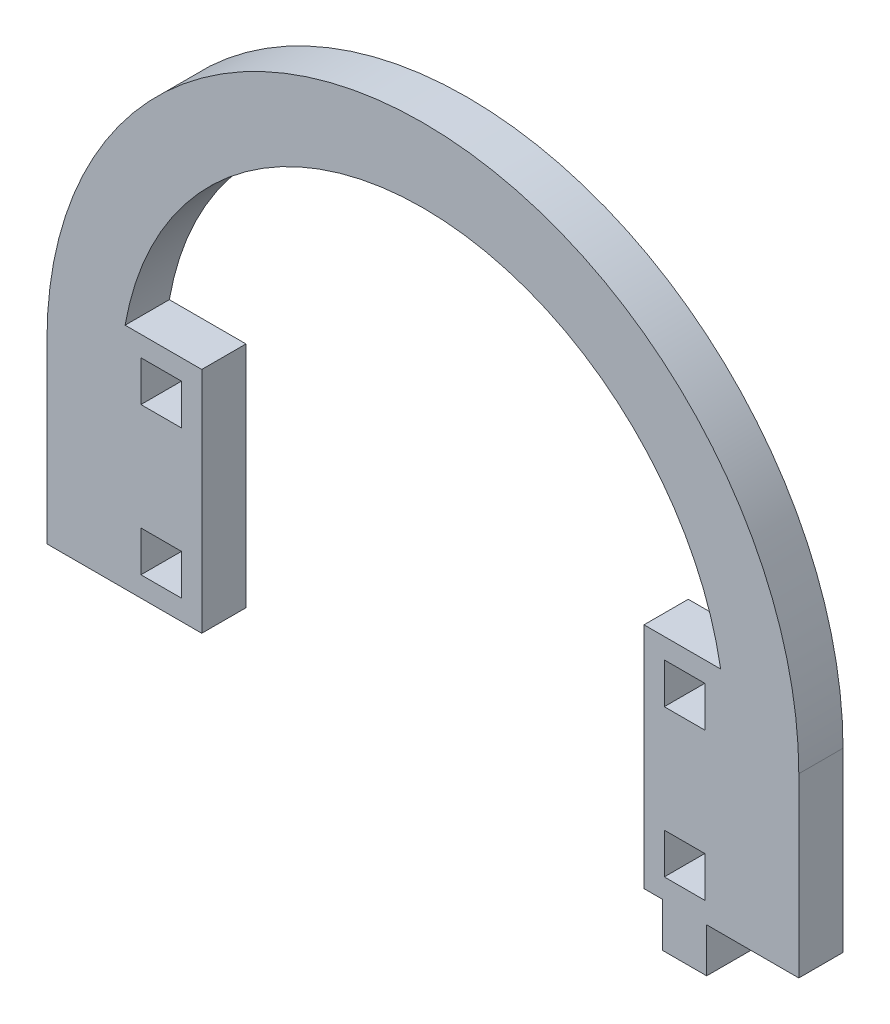
ISO-10303-21;
HEADER;
FILE_DESCRIPTION(('STEP AP214'),'2;1');
FILE_NAME('part.step','',(''),(''),'','','');
FILE_SCHEMA(('AUTOMOTIVE_DESIGN { 1 0 10303 214 1 1 1 1 }'));
ENDSEC;
DATA;
#1=APPLICATION_CONTEXT('core data for automotive mechanical design processes');
#2=APPLICATION_PROTOCOL_DEFINITION('international standard','automotive_design',2000,#1);
#3=PRODUCT_CONTEXT('',#1,'mechanical');
#4=PRODUCT('Part','Part','',(#3));
#5=PRODUCT_RELATED_PRODUCT_CATEGORY('part','',(#4));
#6=PRODUCT_DEFINITION_FORMATION('','',#4);
#7=PRODUCT_DEFINITION_CONTEXT('part definition',#1,'design');
#8=PRODUCT_DEFINITION('design','',#6,#7);
#9=PRODUCT_DEFINITION_SHAPE('','',#8);
#10=(LENGTH_UNIT() NAMED_UNIT(*) SI_UNIT(.MILLI.,.METRE.));
#11=(NAMED_UNIT(*) PLANE_ANGLE_UNIT() SI_UNIT($,.RADIAN.));
#12=(NAMED_UNIT(*) SI_UNIT($,.STERADIAN.) SOLID_ANGLE_UNIT());
#13=UNCERTAINTY_MEASURE_WITH_UNIT(LENGTH_MEASURE(1.E-05),#10,'distance_accuracy_value','');
#14=(GEOMETRIC_REPRESENTATION_CONTEXT(3) GLOBAL_UNCERTAINTY_ASSIGNED_CONTEXT((#13)) GLOBAL_UNIT_ASSIGNED_CONTEXT((#10,
#11,#12)) REPRESENTATION_CONTEXT('',''));
#15=CARTESIAN_POINT('',(0.,0.,0.));
#16=DIRECTION('',(0.,0.,1.));
#17=DIRECTION('',(1.,0.,0.));
#18=AXIS2_PLACEMENT_3D('',#15,#16,#17);
#19=CARTESIAN_POINT('',(3503.90039403022,1295.06850236127,6.));
#20=DIRECTION('',(0.,0.,1.));
#21=DIRECTION('',(1.,0.,0.));
#22=AXIS2_PLACEMENT_3D('',#19,#20,#21);
#23=PLANE('',#22);
#24=CARTESIAN_POINT('',(3503.90039403022,1295.06850236127,6.));
#25=DIRECTION('',(0.,0.,1.));
#26=DIRECTION('',(1.,0.,0.));
#27=AXIS2_PLACEMENT_3D('',#24,#25,#26);
#28=CIRCLE('',#27,50.9999999999999);
#29=CARTESIAN_POINT('',(3554.90039403022,1295.06850236127,6.));
#30=VERTEX_POINT('',#29);
#31=CARTESIAN_POINT('',(3452.90039403022,1295.06850236127,6.));
#32=VERTEX_POINT('',#31);
#33=EDGE_CURVE('E642',#30,#32,#28,.T.);
#34=ORIENTED_EDGE('',*,*,#33,.T.);
#35=DIRECTION('',(0.,-1.,0.));
#36=VECTOR('',#35,1.);
#37=CARTESIAN_POINT('',(3452.90039403022,1295.06850236127,6.));
#38=LINE('',#37,#36);
#39=CARTESIAN_POINT('',(3452.90039403022,1271.06850236127,6.));
#40=VERTEX_POINT('',#39);
#41=EDGE_CURVE('E646',#32,#40,#38,.T.);
#42=ORIENTED_EDGE('',*,*,#41,.T.);
#43=DIRECTION('',(1.,0.,0.));
#44=VECTOR('',#43,1.);
#45=CARTESIAN_POINT('',(3452.90039403022,1271.06850236127,6.));
#46=LINE('',#45,#44);
#47=CARTESIAN_POINT('',(3473.90039403022,1271.06850236127,6.));
#48=VERTEX_POINT('',#47);
#49=EDGE_CURVE('E650',#40,#48,#46,.T.);
#50=ORIENTED_EDGE('',*,*,#49,.T.);
#51=DIRECTION('',(0.,-1.,0.));
#52=VECTOR('',#51,1.);
#53=CARTESIAN_POINT('',(3473.90039403022,1302.06850236127,6.));
#54=LINE('',#53,#52);
#55=CARTESIAN_POINT('',(3473.90039403022,1302.06850236127,6.));
#56=VERTEX_POINT('',#55);
#57=EDGE_CURVE('E653',#56,#48,#54,.T.);
#58=ORIENTED_EDGE('',*,*,#57,.F.);
#59=DIRECTION('',(-1.,0.,0.));
#60=VECTOR('',#59,1.);
#61=CARTESIAN_POINT('',(3473.90039403022,1302.06850236127,6.));
#62=LINE('',#61,#60);
#63=CARTESIAN_POINT('',(3463.50237427677,1302.06850236127,6.));
#64=VERTEX_POINT('',#63);
#65=EDGE_CURVE('E657',#56,#64,#62,.T.);
#66=ORIENTED_EDGE('',*,*,#65,.T.);
#67=CARTESIAN_POINT('',(3503.90039403022,1295.06850236127,6.));
#68=DIRECTION('',(0.,0.,1.));
#69=DIRECTION('',(1.,0.,0.));
#70=AXIS2_PLACEMENT_3D('',#67,#68,#69);
#71=CIRCLE('',#70,41.0000000000002);
#72=CARTESIAN_POINT('',(3544.29841378367,1302.06850236127,6.));
#73=VERTEX_POINT('',#72);
#74=EDGE_CURVE('E660',#73,#64,#71,.T.);
#75=ORIENTED_EDGE('',*,*,#74,.F.);
#76=DIRECTION('',(-1.,0.,0.));
#77=VECTOR('',#76,1.);
#78=CARTESIAN_POINT('',(3544.29841378367,1302.06850236127,6.));
#79=LINE('',#78,#77);
#80=CARTESIAN_POINT('',(3533.90039403022,1302.06850236127,6.));
#81=VERTEX_POINT('',#80);
#82=EDGE_CURVE('E664',#73,#81,#79,.T.);
#83=ORIENTED_EDGE('',*,*,#82,.T.);
#84=DIRECTION('',(0.,-1.,0.));
#85=VECTOR('',#84,1.);
#86=CARTESIAN_POINT('',(3533.90039403022,1302.06850236127,6.));
#87=LINE('',#86,#85);
#88=CARTESIAN_POINT('',(3533.90039403022,1271.06850236127,6.));
#89=VERTEX_POINT('',#88);
#90=EDGE_CURVE('E667',#81,#89,#87,.T.);
#91=ORIENTED_EDGE('',*,*,#90,.T.);
#92=DIRECTION('',(1.,0.,0.));
#93=VECTOR('',#92,1.);
#94=CARTESIAN_POINT('',(3533.90039403022,1271.06850236127,6.));
#95=LINE('',#94,#93);
#96=CARTESIAN_POINT('',(3536.40039403022,1271.06850236127,6.));
#97=VERTEX_POINT('',#96);
#98=EDGE_CURVE('E670',#89,#97,#95,.T.);
#99=ORIENTED_EDGE('',*,*,#98,.T.);
#100=DIRECTION('',(0.,-1.,0.));
#101=VECTOR('',#100,1.);
#102=CARTESIAN_POINT('',(3536.40039403022,1271.06850236127,6.));
#103=LINE('',#102,#101);
#104=CARTESIAN_POINT('',(3536.40039403022,1265.06850236127,6.));
#105=VERTEX_POINT('',#104);
#106=EDGE_CURVE('E673',#97,#105,#103,.T.);
#107=ORIENTED_EDGE('',*,*,#106,.T.);
#108=DIRECTION('',(1.,0.,0.));
#109=VECTOR('',#108,1.);
#110=CARTESIAN_POINT('',(3536.40039403022,1265.06850236127,6.));
#111=LINE('',#110,#109);
#112=CARTESIAN_POINT('',(3542.40039403022,1265.06850236127,6.));
#113=VERTEX_POINT('',#112);
#114=EDGE_CURVE('E676',#105,#113,#111,.T.);
#115=ORIENTED_EDGE('',*,*,#114,.T.);
#116=DIRECTION('',(0.,1.,0.));
#117=VECTOR('',#116,1.);
#118=CARTESIAN_POINT('',(3542.40039403022,1265.06850236127,6.));
#119=LINE('',#118,#117);
#120=CARTESIAN_POINT('',(3542.40039403022,1271.06850236127,6.));
#121=VERTEX_POINT('',#120);
#122=EDGE_CURVE('E679',#113,#121,#119,.T.);
#123=ORIENTED_EDGE('',*,*,#122,.T.);
#124=DIRECTION('',(1.,0.,0.));
#125=VECTOR('',#124,1.);
#126=CARTESIAN_POINT('',(3542.40039403022,1271.06850236127,6.));
#127=LINE('',#126,#125);
#128=CARTESIAN_POINT('',(3554.90039403022,1271.06850236127,6.));
#129=VERTEX_POINT('',#128);
#130=EDGE_CURVE('E682',#121,#129,#127,.T.);
#131=ORIENTED_EDGE('',*,*,#130,.T.);
#132=DIRECTION('',(0.,-1.,0.));
#133=VECTOR('',#132,1.);
#134=CARTESIAN_POINT('',(3554.90039403022,1295.06850236127,6.));
#135=LINE('',#134,#133);
#136=EDGE_CURVE('E685',#30,#129,#135,.T.);
#137=ORIENTED_EDGE('',*,*,#136,.F.);
#138=EDGE_LOOP('',(#34,#42,#50,#58,#66,#75,#83,#91,#99,#107,#115,#123,#131,#137));
#139=FACE_BOUND('',#138,.T.);
#140=DIRECTION('',(0.,1.,0.));
#141=VECTOR('',#140,1.);
#142=CARTESIAN_POINT('',(3471.15039403022,0.,6.));
#143=LINE('',#142,#141);
#144=CARTESIAN_POINT('',(3471.15039403022,1293.81850236127,6.));
#145=VERTEX_POINT('',#144);
#146=CARTESIAN_POINT('',(3471.15039403022,1299.31850236127,6.));
#147=VERTEX_POINT('',#146);
#148=EDGE_CURVE('E602',#145,#147,#143,.T.);
#149=ORIENTED_EDGE('',*,*,#148,.F.);
#150=DIRECTION('',(1.,0.,0.));
#151=VECTOR('',#150,1.);
#152=CARTESIAN_POINT('',(0.,1293.81850236127,6.));
#153=LINE('',#152,#151);
#154=CARTESIAN_POINT('',(3465.65039403022,1293.81850236127,6.));
#155=VERTEX_POINT('',#154);
#156=EDGE_CURVE('E599',#155,#145,#153,.T.);
#157=ORIENTED_EDGE('',*,*,#156,.F.);
#158=DIRECTION('',(0.,-1.,0.));
#159=VECTOR('',#158,1.);
#160=CARTESIAN_POINT('',(3465.65039403022,0.,6.));
#161=LINE('',#160,#159);
#162=CARTESIAN_POINT('',(3465.65039403022,1299.31850236127,6.));
#163=VERTEX_POINT('',#162);
#164=EDGE_CURVE('E610',#163,#155,#161,.T.);
#165=ORIENTED_EDGE('',*,*,#164,.F.);
#166=DIRECTION('',(-1.,0.,0.));
#167=VECTOR('',#166,1.);
#168=CARTESIAN_POINT('',(0.,1299.31850236127,6.));
#169=LINE('',#168,#167);
#170=EDGE_CURVE('E606',#147,#163,#169,.T.);
#171=ORIENTED_EDGE('',*,*,#170,.F.);
#172=EDGE_LOOP('',(#149,#157,#165,#171));
#173=FACE_BOUND('',#172,.T.);
#174=DIRECTION('',(0.,1.,0.));
#175=VECTOR('',#174,1.);
#176=CARTESIAN_POINT('',(3471.15039403022,0.,6.));
#177=LINE('',#176,#175);
#178=CARTESIAN_POINT('',(3471.15039403022,1273.81850236127,6.));
#179=VERTEX_POINT('',#178);
#180=CARTESIAN_POINT('',(3471.15039403022,1279.31850236127,6.));
#181=VERTEX_POINT('',#180);
#182=EDGE_CURVE('E559',#179,#181,#177,.T.);
#183=ORIENTED_EDGE('',*,*,#182,.F.);
#184=DIRECTION('',(1.,0.,0.));
#185=VECTOR('',#184,1.);
#186=CARTESIAN_POINT('',(0.,1273.81850236127,6.));
#187=LINE('',#186,#185);
#188=CARTESIAN_POINT('',(3465.65039403022,1273.81850236127,6.));
#189=VERTEX_POINT('',#188);
#190=EDGE_CURVE('E556',#189,#179,#187,.T.);
#191=ORIENTED_EDGE('',*,*,#190,.F.);
#192=DIRECTION('',(0.,-1.,0.));
#193=VECTOR('',#192,1.);
#194=CARTESIAN_POINT('',(3465.65039403022,0.,6.));
#195=LINE('',#194,#193);
#196=CARTESIAN_POINT('',(3465.65039403022,1279.31850236127,6.));
#197=VERTEX_POINT('',#196);
#198=EDGE_CURVE('E567',#197,#189,#195,.T.);
#199=ORIENTED_EDGE('',*,*,#198,.F.);
#200=DIRECTION('',(-1.,0.,0.));
#201=VECTOR('',#200,1.);
#202=CARTESIAN_POINT('',(0.,1279.31850236127,6.));
#203=LINE('',#202,#201);
#204=EDGE_CURVE('E563',#181,#197,#203,.T.);
#205=ORIENTED_EDGE('',*,*,#204,.F.);
#206=EDGE_LOOP('',(#183,#191,#199,#205));
#207=FACE_BOUND('',#206,.T.);
#208=DIRECTION('',(0.,1.,0.));
#209=VECTOR('',#208,1.);
#210=CARTESIAN_POINT('',(3542.15039403022,0.,6.));
#211=LINE('',#210,#209);
#212=CARTESIAN_POINT('',(3542.15039403022,1293.81850236127,6.));
#213=VERTEX_POINT('',#212);
#214=CARTESIAN_POINT('',(3542.15039403022,1299.31850236127,6.));
#215=VERTEX_POINT('',#214);
#216=EDGE_CURVE('E516',#213,#215,#211,.T.);
#217=ORIENTED_EDGE('',*,*,#216,.F.);
#218=DIRECTION('',(1.,0.,0.));
#219=VECTOR('',#218,1.);
#220=CARTESIAN_POINT('',(0.,1293.81850236127,6.));
#221=LINE('',#220,#219);
#222=CARTESIAN_POINT('',(3536.65039403022,1293.81850236127,6.));
#223=VERTEX_POINT('',#222);
#224=EDGE_CURVE('E513',#223,#213,#221,.T.);
#225=ORIENTED_EDGE('',*,*,#224,.F.);
#226=DIRECTION('',(0.,-1.,0.));
#227=VECTOR('',#226,1.);
#228=CARTESIAN_POINT('',(3536.65039403022,0.,6.));
#229=LINE('',#228,#227);
#230=CARTESIAN_POINT('',(3536.65039403022,1299.31850236127,6.));
#231=VERTEX_POINT('',#230);
#232=EDGE_CURVE('E524',#231,#223,#229,.T.);
#233=ORIENTED_EDGE('',*,*,#232,.F.);
#234=DIRECTION('',(-1.,0.,0.));
#235=VECTOR('',#234,1.);
#236=CARTESIAN_POINT('',(0.,1299.31850236127,6.));
#237=LINE('',#236,#235);
#238=EDGE_CURVE('E520',#215,#231,#237,.T.);
#239=ORIENTED_EDGE('',*,*,#238,.F.);
#240=EDGE_LOOP('',(#217,#225,#233,#239));
#241=FACE_BOUND('',#240,.T.);
#242=DIRECTION('',(0.,1.,0.));
#243=VECTOR('',#242,1.);
#244=CARTESIAN_POINT('',(3542.15039403022,0.,6.));
#245=LINE('',#244,#243);
#246=CARTESIAN_POINT('',(3542.15039403022,1273.81850236127,6.));
#247=VERTEX_POINT('',#246);
#248=CARTESIAN_POINT('',(3542.15039403022,1279.31850236127,6.));
#249=VERTEX_POINT('',#248);
#250=EDGE_CURVE('E474',#247,#249,#245,.T.);
#251=ORIENTED_EDGE('',*,*,#250,.F.);
#252=DIRECTION('',(1.,0.,0.));
#253=VECTOR('',#252,1.);
#254=CARTESIAN_POINT('',(0.,1273.81850236127,6.));
#255=LINE('',#254,#253);
#256=CARTESIAN_POINT('',(3536.65039403022,1273.81850236127,6.));
#257=VERTEX_POINT('',#256);
#258=EDGE_CURVE('E465',#257,#247,#255,.T.);
#259=ORIENTED_EDGE('',*,*,#258,.F.);
#260=DIRECTION('',(0.,-1.,0.));
#261=VECTOR('',#260,1.);
#262=CARTESIAN_POINT('',(3536.65039403022,0.,6.));
#263=LINE('',#262,#261);
#264=CARTESIAN_POINT('',(3536.65039403022,1279.31850236127,6.));
#265=VERTEX_POINT('',#264);
#266=EDGE_CURVE('E491',#265,#257,#263,.T.);
#267=ORIENTED_EDGE('',*,*,#266,.F.);
#268=DIRECTION('',(-1.,0.,0.));
#269=VECTOR('',#268,1.);
#270=CARTESIAN_POINT('',(0.,1279.31850236127,6.));
#271=LINE('',#270,#269);
#272=EDGE_CURVE('E487',#249,#265,#271,.T.);
#273=ORIENTED_EDGE('',*,*,#272,.F.);
#274=EDGE_LOOP('',(#251,#259,#267,#273));
#275=FACE_BOUND('',#274,.T.);
#276=ADVANCED_FACE('F267',(#139,#173,#207,#241,#275),#23,.T.);
#277=CARTESIAN_POINT('',(3503.90039403022,1295.06850236127,0.));
#278=DIRECTION('',(0.,0.,1.));
#279=DIRECTION('',(1.,0.,0.));
#280=AXIS2_PLACEMENT_3D('',#277,#278,#279);
#281=PLANE('',#280);
#282=DIRECTION('',(1.,0.,0.));
#283=VECTOR('',#282,1.);
#284=CARTESIAN_POINT('',(0.,1293.81850236127,0.));
#285=LINE('',#284,#283);
#286=CARTESIAN_POINT('',(3536.65039403022,1293.81850236127,0.));
#287=VERTEX_POINT('',#286);
#288=CARTESIAN_POINT('',(3542.15039403022,1293.81850236127,0.));
#289=VERTEX_POINT('',#288);
#290=EDGE_CURVE('E483',#287,#289,#285,.T.);
#291=ORIENTED_EDGE('',*,*,#290,.T.);
#292=DIRECTION('',(0.,1.,0.));
#293=VECTOR('',#292,1.);
#294=CARTESIAN_POINT('',(3542.15039403022,0.,0.));
#295=LINE('',#294,#293);
#296=CARTESIAN_POINT('',(3542.15039403022,1299.31850236127,0.));
#297=VERTEX_POINT('',#296);
#298=EDGE_CURVE('E531',#289,#297,#295,.T.);
#299=ORIENTED_EDGE('',*,*,#298,.T.);
#300=DIRECTION('',(-1.,0.,0.));
#301=VECTOR('',#300,1.);
#302=CARTESIAN_POINT('',(0.,1299.31850236127,0.));
#303=LINE('',#302,#301);
#304=CARTESIAN_POINT('',(3536.65039403022,1299.31850236127,0.));
#305=VERTEX_POINT('',#304);
#306=EDGE_CURVE('E535',#297,#305,#303,.T.);
#307=ORIENTED_EDGE('',*,*,#306,.T.);
#308=DIRECTION('',(0.,-1.,0.));
#309=VECTOR('',#308,1.);
#310=CARTESIAN_POINT('',(3536.65039403022,0.,0.));
#311=LINE('',#310,#309);
#312=EDGE_CURVE('E517',#305,#287,#311,.T.);
#313=ORIENTED_EDGE('',*,*,#312,.T.);
#314=EDGE_LOOP('',(#291,#299,#307,#313));
#315=FACE_BOUND('',#314,.T.);
#316=DIRECTION('',(1.,0.,0.));
#317=VECTOR('',#316,1.);
#318=CARTESIAN_POINT('',(0.,1293.81850236127,0.));
#319=LINE('',#318,#317);
#320=CARTESIAN_POINT('',(3465.65039403022,1293.81850236127,0.));
#321=VERTEX_POINT('',#320);
#322=CARTESIAN_POINT('',(3471.15039403022,1293.81850236127,0.));
#323=VERTEX_POINT('',#322);
#324=EDGE_CURVE('E598',#321,#323,#319,.T.);
#325=ORIENTED_EDGE('',*,*,#324,.T.);
#326=DIRECTION('',(0.,1.,0.));
#327=VECTOR('',#326,1.);
#328=CARTESIAN_POINT('',(3471.15039403022,0.,0.));
#329=LINE('',#328,#327);
#330=CARTESIAN_POINT('',(3471.15039403022,1299.31850236127,0.));
#331=VERTEX_POINT('',#330);
#332=EDGE_CURVE('E617',#323,#331,#329,.T.);
#333=ORIENTED_EDGE('',*,*,#332,.T.);
#334=DIRECTION('',(-1.,0.,0.));
#335=VECTOR('',#334,1.);
#336=CARTESIAN_POINT('',(0.,1299.31850236127,0.));
#337=LINE('',#336,#335);
#338=CARTESIAN_POINT('',(3465.65039403022,1299.31850236127,0.));
#339=VERTEX_POINT('',#338);
#340=EDGE_CURVE('E621',#331,#339,#337,.T.);
#341=ORIENTED_EDGE('',*,*,#340,.T.);
#342=DIRECTION('',(0.,-1.,0.));
#343=VECTOR('',#342,1.);
#344=CARTESIAN_POINT('',(3465.65039403022,0.,0.));
#345=LINE('',#344,#343);
#346=EDGE_CURVE('E603',#339,#321,#345,.T.);
#347=ORIENTED_EDGE('',*,*,#346,.T.);
#348=EDGE_LOOP('',(#325,#333,#341,#347));
#349=FACE_BOUND('',#348,.T.);
#350=CARTESIAN_POINT('',(3503.90039403022,1295.06850236127,0.));
#351=DIRECTION('',(0.,0.,1.));
#352=DIRECTION('',(1.,0.,0.));
#353=AXIS2_PLACEMENT_3D('',#350,#351,#352);
#354=CIRCLE('',#353,50.9999999999999);
#355=CARTESIAN_POINT('',(3554.90039403022,1295.06850236127,0.));
#356=VERTEX_POINT('',#355);
#357=CARTESIAN_POINT('',(3452.90039403022,1295.06850236127,0.));
#358=VERTEX_POINT('',#357);
#359=EDGE_CURVE('E641',#356,#358,#354,.T.);
#360=ORIENTED_EDGE('',*,*,#359,.F.);
#361=DIRECTION('',(0.,-1.,0.));
#362=VECTOR('',#361,1.);
#363=CARTESIAN_POINT('',(3554.90039403022,1295.06850236127,0.));
#364=LINE('',#363,#362);
#365=CARTESIAN_POINT('',(3554.90039403022,1271.06850236127,0.));
#366=VERTEX_POINT('',#365);
#367=EDGE_CURVE('E647',#356,#366,#364,.T.);
#368=ORIENTED_EDGE('',*,*,#367,.T.);
#369=DIRECTION('',(1.,0.,0.));
#370=VECTOR('',#369,1.);
#371=CARTESIAN_POINT('',(3542.40039403022,1271.06850236127,0.));
#372=LINE('',#371,#370);
#373=CARTESIAN_POINT('',(3542.40039403022,1271.06850236127,0.));
#374=VERTEX_POINT('',#373);
#375=EDGE_CURVE('E731',#374,#366,#372,.T.);
#376=ORIENTED_EDGE('',*,*,#375,.F.);
#377=DIRECTION('',(0.,1.,0.));
#378=VECTOR('',#377,1.);
#379=CARTESIAN_POINT('',(3542.40039403022,1265.06850236127,0.));
#380=LINE('',#379,#378);
#381=CARTESIAN_POINT('',(3542.40039403022,1265.06850236127,0.));
#382=VERTEX_POINT('',#381);
#383=EDGE_CURVE('E728',#382,#374,#380,.T.);
#384=ORIENTED_EDGE('',*,*,#383,.F.);
#385=DIRECTION('',(1.,0.,0.));
#386=VECTOR('',#385,1.);
#387=CARTESIAN_POINT('',(3536.40039403022,1265.06850236127,0.));
#388=LINE('',#387,#386);
#389=CARTESIAN_POINT('',(3536.40039403022,1265.06850236127,0.));
#390=VERTEX_POINT('',#389);
#391=EDGE_CURVE('E725',#390,#382,#388,.T.);
#392=ORIENTED_EDGE('',*,*,#391,.F.);
#393=DIRECTION('',(0.,-1.,0.));
#394=VECTOR('',#393,1.);
#395=CARTESIAN_POINT('',(3536.40039403022,1271.06850236127,0.));
#396=LINE('',#395,#394);
#397=CARTESIAN_POINT('',(3536.40039403022,1271.06850236127,0.));
#398=VERTEX_POINT('',#397);
#399=EDGE_CURVE('E722',#398,#390,#396,.T.);
#400=ORIENTED_EDGE('',*,*,#399,.F.);
#401=DIRECTION('',(1.,0.,0.));
#402=VECTOR('',#401,1.);
#403=CARTESIAN_POINT('',(3533.90039403022,1271.06850236127,0.));
#404=LINE('',#403,#402);
#405=CARTESIAN_POINT('',(3533.90039403022,1271.06850236127,0.));
#406=VERTEX_POINT('',#405);
#407=EDGE_CURVE('E719',#406,#398,#404,.T.);
#408=ORIENTED_EDGE('',*,*,#407,.F.);
#409=DIRECTION('',(0.,-1.,0.));
#410=VECTOR('',#409,1.);
#411=CARTESIAN_POINT('',(3533.90039403022,1302.06850236127,0.));
#412=LINE('',#411,#410);
#413=CARTESIAN_POINT('',(3533.90039403022,1302.06850236127,0.));
#414=VERTEX_POINT('',#413);
#415=EDGE_CURVE('E716',#414,#406,#412,.T.);
#416=ORIENTED_EDGE('',*,*,#415,.F.);
#417=DIRECTION('',(-1.,0.,0.));
#418=VECTOR('',#417,1.);
#419=CARTESIAN_POINT('',(3544.29841378367,1302.06850236127,0.));
#420=LINE('',#419,#418);
#421=CARTESIAN_POINT('',(3544.29841378367,1302.06850236127,0.));
#422=VERTEX_POINT('',#421);
#423=EDGE_CURVE('E713',#422,#414,#420,.T.);
#424=ORIENTED_EDGE('',*,*,#423,.F.);
#425=CARTESIAN_POINT('',(3503.90039403022,1295.06850236127,0.));
#426=DIRECTION('',(0.,0.,1.));
#427=DIRECTION('',(1.,0.,0.));
#428=AXIS2_PLACEMENT_3D('',#425,#426,#427);
#429=CIRCLE('',#428,41.0000000000002);
#430=CARTESIAN_POINT('',(3463.50237427677,1302.06850236127,0.));
#431=VERTEX_POINT('',#430);
#432=EDGE_CURVE('E709',#422,#431,#429,.T.);
#433=ORIENTED_EDGE('',*,*,#432,.T.);
#434=DIRECTION('',(-1.,0.,0.));
#435=VECTOR('',#434,1.);
#436=CARTESIAN_POINT('',(3473.90039403022,1302.06850236127,0.));
#437=LINE('',#436,#435);
#438=CARTESIAN_POINT('',(3473.90039403022,1302.06850236127,0.));
#439=VERTEX_POINT('',#438);
#440=EDGE_CURVE('E705',#439,#431,#437,.T.);
#441=ORIENTED_EDGE('',*,*,#440,.F.);
#442=DIRECTION('',(0.,-1.,0.));
#443=VECTOR('',#442,1.);
#444=CARTESIAN_POINT('',(3473.90039403022,1302.06850236127,0.));
#445=LINE('',#444,#443);
#446=CARTESIAN_POINT('',(3473.90039403022,1271.06850236127,0.));
#447=VERTEX_POINT('',#446);
#448=EDGE_CURVE('E701',#439,#447,#445,.T.);
#449=ORIENTED_EDGE('',*,*,#448,.T.);
#450=DIRECTION('',(1.,0.,0.));
#451=VECTOR('',#450,1.);
#452=CARTESIAN_POINT('',(3462.90039403022,1271.06850236127,0.));
#453=LINE('',#452,#451);
#454=CARTESIAN_POINT('',(3452.90039403022,1271.06850236127,0.));
#455=VERTEX_POINT('',#454);
#456=EDGE_CURVE('E697',#455,#447,#453,.T.);
#457=ORIENTED_EDGE('',*,*,#456,.F.);
#458=DIRECTION('',(0.,-1.,0.));
#459=VECTOR('',#458,1.);
#460=CARTESIAN_POINT('',(3452.90039403022,1295.06850236127,0.));
#461=LINE('',#460,#459);
#462=EDGE_CURVE('E693',#358,#455,#461,.T.);
#463=ORIENTED_EDGE('',*,*,#462,.F.);
#464=EDGE_LOOP('',(#360,#368,#376,#384,#392,#400,#408,#416,#424,#433,#441,#449,#457,#463));
#465=FACE_BOUND('',#464,.T.);
#466=DIRECTION('',(1.,0.,0.));
#467=VECTOR('',#466,1.);
#468=CARTESIAN_POINT('',(0.,1273.81850236127,0.));
#469=LINE('',#468,#467);
#470=CARTESIAN_POINT('',(3465.65039403022,1273.81850236127,0.));
#471=VERTEX_POINT('',#470);
#472=CARTESIAN_POINT('',(3471.15039403022,1273.81850236127,0.));
#473=VERTEX_POINT('',#472);
#474=EDGE_CURVE('E555',#471,#473,#469,.T.);
#475=ORIENTED_EDGE('',*,*,#474,.T.);
#476=DIRECTION('',(0.,1.,0.));
#477=VECTOR('',#476,1.);
#478=CARTESIAN_POINT('',(3471.15039403022,0.,0.));
#479=LINE('',#478,#477);
#480=CARTESIAN_POINT('',(3471.15039403022,1279.31850236127,0.));
#481=VERTEX_POINT('',#480);
#482=EDGE_CURVE('E574',#473,#481,#479,.T.);
#483=ORIENTED_EDGE('',*,*,#482,.T.);
#484=DIRECTION('',(-1.,0.,0.));
#485=VECTOR('',#484,1.);
#486=CARTESIAN_POINT('',(0.,1279.31850236127,0.));
#487=LINE('',#486,#485);
#488=CARTESIAN_POINT('',(3465.65039403022,1279.31850236127,0.));
#489=VERTEX_POINT('',#488);
#490=EDGE_CURVE('E578',#481,#489,#487,.T.);
#491=ORIENTED_EDGE('',*,*,#490,.T.);
#492=DIRECTION('',(0.,-1.,0.));
#493=VECTOR('',#492,1.);
#494=CARTESIAN_POINT('',(3465.65039403022,0.,0.));
#495=LINE('',#494,#493);
#496=EDGE_CURVE('E560',#489,#471,#495,.T.);
#497=ORIENTED_EDGE('',*,*,#496,.T.);
#498=EDGE_LOOP('',(#475,#483,#491,#497));
#499=FACE_BOUND('',#498,.T.);
#500=DIRECTION('',(1.,0.,0.));
#501=VECTOR('',#500,1.);
#502=CARTESIAN_POINT('',(0.,1273.81850236127,0.));
#503=LINE('',#502,#501);
#504=CARTESIAN_POINT('',(3536.65039403022,1273.81850236127,0.));
#505=VERTEX_POINT('',#504);
#506=CARTESIAN_POINT('',(3542.15039403022,1273.81850236127,0.));
#507=VERTEX_POINT('',#506);
#508=EDGE_CURVE('E291',#505,#507,#503,.T.);
#509=ORIENTED_EDGE('',*,*,#508,.T.);
#510=DIRECTION('',(0.,1.,0.));
#511=VECTOR('',#510,1.);
#512=CARTESIAN_POINT('',(3542.15039403022,0.,0.));
#513=LINE('',#512,#511);
#514=CARTESIAN_POINT('',(3542.15039403022,1279.31850236127,0.));
#515=VERTEX_POINT('',#514);
#516=EDGE_CURVE('E481',#507,#515,#513,.T.);
#517=ORIENTED_EDGE('',*,*,#516,.T.);
#518=DIRECTION('',(-1.,0.,0.));
#519=VECTOR('',#518,1.);
#520=CARTESIAN_POINT('',(0.,1279.31850236127,0.));
#521=LINE('',#520,#519);
#522=CARTESIAN_POINT('',(3536.65039403022,1279.31850236127,0.));
#523=VERTEX_POINT('',#522);
#524=EDGE_CURVE('E500',#515,#523,#521,.T.);
#525=ORIENTED_EDGE('',*,*,#524,.T.);
#526=DIRECTION('',(0.,-1.,0.));
#527=VECTOR('',#526,1.);
#528=CARTESIAN_POINT('',(3536.65039403022,0.,0.));
#529=LINE('',#528,#527);
#530=EDGE_CURVE('E475',#523,#505,#529,.T.);
#531=ORIENTED_EDGE('',*,*,#530,.T.);
#532=EDGE_LOOP('',(#509,#517,#525,#531));
#533=FACE_BOUND('',#532,.T.);
#534=ADVANCED_FACE('F790',(#315,#349,#465,#499,#533),#281,.F.);
#535=CARTESIAN_POINT('',(3503.90039403022,1295.06850236127,6.));
#536=DIRECTION('',(0.,0.,-1.));
#537=DIRECTION('',(-1.,0.,0.));
#538=AXIS2_PLACEMENT_3D('',#535,#536,#537);
#539=CYLINDRICAL_SURFACE('',#538,50.9999999999999);
#540=ORIENTED_EDGE('',*,*,#359,.T.);
#541=DIRECTION('',(0.,0.,-1.));
#542=VECTOR('',#541,1.);
#543=CARTESIAN_POINT('',(3452.90039403022,1295.06850236127,6.));
#544=LINE('',#543,#542);
#545=EDGE_CURVE('E12',#32,#358,#544,.T.);
#546=ORIENTED_EDGE('',*,*,#545,.F.);
#547=ORIENTED_EDGE('',*,*,#33,.F.);
#548=DIRECTION('',(0.,0.,-1.));
#549=VECTOR('',#548,1.);
#550=CARTESIAN_POINT('',(3554.90039403022,1295.06850236127,6.));
#551=LINE('',#550,#549);
#552=EDGE_CURVE('E689',#30,#356,#551,.T.);
#553=ORIENTED_EDGE('',*,*,#552,.T.);
#554=EDGE_LOOP('',(#540,#546,#547,#553));
#555=FACE_BOUND('',#554,.T.);
#556=ADVANCED_FACE('F269',(#555),#539,.T.);
#557=CARTESIAN_POINT('',(3452.90039403022,1295.06850236127,6.));
#558=DIRECTION('',(1.,0.,0.));
#559=DIRECTION('',(0.,0.,-1.));
#560=AXIS2_PLACEMENT_3D('',#557,#558,#559);
#561=PLANE('',#560);
#562=ORIENTED_EDGE('',*,*,#462,.T.);
#563=DIRECTION('',(0.,0.,-1.));
#564=VECTOR('',#563,1.);
#565=CARTESIAN_POINT('',(3452.90039403022,1271.06850236127,6.));
#566=LINE('',#565,#564);
#567=EDGE_CURVE('E276',#40,#455,#566,.T.);
#568=ORIENTED_EDGE('',*,*,#567,.F.);
#569=ORIENTED_EDGE('',*,*,#41,.F.);
#570=ORIENTED_EDGE('',*,*,#545,.T.);
#571=EDGE_LOOP('',(#562,#568,#569,#570));
#572=FACE_BOUND('',#571,.T.);
#573=ADVANCED_FACE('F786',(#572),#561,.F.);
#574=CARTESIAN_POINT('',(3462.90039403022,1271.06850236127,6.));
#575=DIRECTION('',(0.,1.,0.));
#576=DIRECTION('',(0.,0.,1.));
#577=AXIS2_PLACEMENT_3D('',#574,#575,#576);
#578=PLANE('',#577);
#579=ORIENTED_EDGE('',*,*,#456,.T.);
#580=DIRECTION('',(0.,0.,-1.));
#581=VECTOR('',#580,1.);
#582=CARTESIAN_POINT('',(3473.90039403022,1271.06850236127,6.));
#583=LINE('',#582,#581);
#584=EDGE_CURVE('E776',#48,#447,#583,.T.);
#585=ORIENTED_EDGE('',*,*,#584,.F.);
#586=ORIENTED_EDGE('',*,*,#49,.F.);
#587=ORIENTED_EDGE('',*,*,#567,.T.);
#588=EDGE_LOOP('',(#579,#585,#586,#587));
#589=FACE_BOUND('',#588,.T.);
#590=ADVANCED_FACE('F783',(#589),#578,.F.);
#591=CARTESIAN_POINT('',(3473.90039403022,1302.06850236127,6.));
#592=DIRECTION('',(1.,0.,0.));
#593=DIRECTION('',(0.,0.,-1.));
#594=AXIS2_PLACEMENT_3D('',#591,#592,#593);
#595=PLANE('',#594);
#596=ORIENTED_EDGE('',*,*,#448,.F.);
#597=DIRECTION('',(0.,0.,-1.));
#598=VECTOR('',#597,1.);
#599=CARTESIAN_POINT('',(3473.90039403022,1302.06850236127,6.));
#600=LINE('',#599,#598);
#601=EDGE_CURVE('E773',#56,#439,#600,.T.);
#602=ORIENTED_EDGE('',*,*,#601,.F.);
#603=ORIENTED_EDGE('',*,*,#57,.T.);
#604=ORIENTED_EDGE('',*,*,#584,.T.);
#605=EDGE_LOOP('',(#596,#602,#603,#604));
#606=FACE_BOUND('',#605,.T.);
#607=ADVANCED_FACE('F796',(#606),#595,.T.);
#608=CARTESIAN_POINT('',(3473.90039403022,1302.06850236127,6.));
#609=DIRECTION('',(0.,-1.,0.));
#610=DIRECTION('',(0.,0.,-1.));
#611=AXIS2_PLACEMENT_3D('',#608,#609,#610);
#612=PLANE('',#611);
#613=ORIENTED_EDGE('',*,*,#440,.T.);
#614=DIRECTION('',(0.,0.,-1.));
#615=VECTOR('',#614,1.);
#616=CARTESIAN_POINT('',(3463.50237427677,1302.06850236127,6.));
#617=LINE('',#616,#615);
#618=EDGE_CURVE('E770',#64,#431,#617,.T.);
#619=ORIENTED_EDGE('',*,*,#618,.F.);
#620=ORIENTED_EDGE('',*,*,#65,.F.);
#621=ORIENTED_EDGE('',*,*,#601,.T.);
#622=EDGE_LOOP('',(#613,#619,#620,#621));
#623=FACE_BOUND('',#622,.T.);
#624=ADVANCED_FACE('F846',(#623),#612,.F.);
#625=CARTESIAN_POINT('',(3503.90039403022,1295.06850236127,6.));
#626=DIRECTION('',(0.,0.,-1.));
#627=DIRECTION('',(-1.,0.,0.));
#628=AXIS2_PLACEMENT_3D('',#625,#626,#627);
#629=CYLINDRICAL_SURFACE('',#628,41.0000000000002);
#630=ORIENTED_EDGE('',*,*,#432,.F.);
#631=DIRECTION('',(0.,0.,-1.));
#632=VECTOR('',#631,1.);
#633=CARTESIAN_POINT('',(3544.29841378367,1302.06850236127,6.));
#634=LINE('',#633,#632);
#635=EDGE_CURVE('E767',#73,#422,#634,.T.);
#636=ORIENTED_EDGE('',*,*,#635,.F.);
#637=ORIENTED_EDGE('',*,*,#74,.T.);
#638=ORIENTED_EDGE('',*,*,#618,.T.);
#639=EDGE_LOOP('',(#630,#636,#637,#638));
#640=FACE_BOUND('',#639,.T.);
#641=ADVANCED_FACE('F843',(#640),#629,.F.);
#642=CARTESIAN_POINT('',(3544.29841378367,1302.06850236127,6.));
#643=DIRECTION('',(0.,-1.,0.));
#644=DIRECTION('',(0.,0.,-1.));
#645=AXIS2_PLACEMENT_3D('',#642,#643,#644);
#646=PLANE('',#645);
#647=ORIENTED_EDGE('',*,*,#423,.T.);
#648=DIRECTION('',(0.,0.,-1.));
#649=VECTOR('',#648,1.);
#650=CARTESIAN_POINT('',(3533.90039403022,1302.06850236127,6.));
#651=LINE('',#650,#649);
#652=EDGE_CURVE('E763',#81,#414,#651,.T.);
#653=ORIENTED_EDGE('',*,*,#652,.F.);
#654=ORIENTED_EDGE('',*,*,#82,.F.);
#655=ORIENTED_EDGE('',*,*,#635,.T.);
#656=EDGE_LOOP('',(#647,#653,#654,#655));
#657=FACE_BOUND('',#656,.T.);
#658=ADVANCED_FACE('F853',(#657),#646,.F.);
#659=CARTESIAN_POINT('',(3533.90039403022,1302.06850236127,6.));
#660=DIRECTION('',(1.,0.,0.));
#661=DIRECTION('',(0.,0.,-1.));
#662=AXIS2_PLACEMENT_3D('',#659,#660,#661);
#663=PLANE('',#662);
#664=ORIENTED_EDGE('',*,*,#415,.T.);
#665=DIRECTION('',(0.,0.,-1.));
#666=VECTOR('',#665,1.);
#667=CARTESIAN_POINT('',(3533.90039403022,1271.06850236127,6.));
#668=LINE('',#667,#666);
#669=EDGE_CURVE('E759',#89,#406,#668,.T.);
#670=ORIENTED_EDGE('',*,*,#669,.F.);
#671=ORIENTED_EDGE('',*,*,#90,.F.);
#672=ORIENTED_EDGE('',*,*,#652,.T.);
#673=EDGE_LOOP('',(#664,#670,#671,#672));
#674=FACE_BOUND('',#673,.T.);
#675=ADVANCED_FACE('F837',(#674),#663,.F.);
#676=CARTESIAN_POINT('',(3533.90039403022,1271.06850236127,6.));
#677=DIRECTION('',(0.,1.,0.));
#678=DIRECTION('',(0.,0.,1.));
#679=AXIS2_PLACEMENT_3D('',#676,#677,#678);
#680=PLANE('',#679);
#681=ORIENTED_EDGE('',*,*,#407,.T.);
#682=DIRECTION('',(0.,0.,-1.));
#683=VECTOR('',#682,1.);
#684=CARTESIAN_POINT('',(3536.40039403022,1271.06850236127,6.));
#685=LINE('',#684,#683);
#686=EDGE_CURVE('E755',#97,#398,#685,.T.);
#687=ORIENTED_EDGE('',*,*,#686,.F.);
#688=ORIENTED_EDGE('',*,*,#98,.F.);
#689=ORIENTED_EDGE('',*,*,#669,.T.);
#690=EDGE_LOOP('',(#681,#687,#688,#689));
#691=FACE_BOUND('',#690,.T.);
#692=ADVANCED_FACE('F833',(#691),#680,.F.);
#693=CARTESIAN_POINT('',(3536.40039403022,1271.06850236127,6.));
#694=DIRECTION('',(1.,0.,0.));
#695=DIRECTION('',(0.,0.,-1.));
#696=AXIS2_PLACEMENT_3D('',#693,#694,#695);
#697=PLANE('',#696);
#698=ORIENTED_EDGE('',*,*,#399,.T.);
#699=DIRECTION('',(0.,0.,-1.));
#700=VECTOR('',#699,1.);
#701=CARTESIAN_POINT('',(3536.40039403022,1265.06850236127,6.));
#702=LINE('',#701,#700);
#703=EDGE_CURVE('E751',#105,#390,#702,.T.);
#704=ORIENTED_EDGE('',*,*,#703,.F.);
#705=ORIENTED_EDGE('',*,*,#106,.F.);
#706=ORIENTED_EDGE('',*,*,#686,.T.);
#707=EDGE_LOOP('',(#698,#704,#705,#706));
#708=FACE_BOUND('',#707,.T.);
#709=ADVANCED_FACE('F828',(#708),#697,.F.);
#710=CARTESIAN_POINT('',(3536.40039403022,1265.06850236127,6.));
#711=DIRECTION('',(0.,1.,0.));
#712=DIRECTION('',(0.,0.,1.));
#713=AXIS2_PLACEMENT_3D('',#710,#711,#712);
#714=PLANE('',#713);
#715=ORIENTED_EDGE('',*,*,#391,.T.);
#716=DIRECTION('',(0.,0.,-1.));
#717=VECTOR('',#716,1.);
#718=CARTESIAN_POINT('',(3542.40039403022,1265.06850236127,6.));
#719=LINE('',#718,#717);
#720=EDGE_CURVE('E747',#113,#382,#719,.T.);
#721=ORIENTED_EDGE('',*,*,#720,.F.);
#722=ORIENTED_EDGE('',*,*,#114,.F.);
#723=ORIENTED_EDGE('',*,*,#703,.T.);
#724=EDGE_LOOP('',(#715,#721,#722,#723));
#725=FACE_BOUND('',#724,.T.);
#726=ADVANCED_FACE('F822',(#725),#714,.F.);
#727=CARTESIAN_POINT('',(3542.40039403022,1265.06850236127,6.));
#728=DIRECTION('',(-1.,0.,0.));
#729=DIRECTION('',(0.,0.,1.));
#730=AXIS2_PLACEMENT_3D('',#727,#728,#729);
#731=PLANE('',#730);
#732=ORIENTED_EDGE('',*,*,#383,.T.);
#733=DIRECTION('',(0.,0.,-1.));
#734=VECTOR('',#733,1.);
#735=CARTESIAN_POINT('',(3542.40039403022,1271.06850236127,6.));
#736=LINE('',#735,#734);
#737=EDGE_CURVE('E743',#121,#374,#736,.T.);
#738=ORIENTED_EDGE('',*,*,#737,.F.);
#739=ORIENTED_EDGE('',*,*,#122,.F.);
#740=ORIENTED_EDGE('',*,*,#720,.T.);
#741=EDGE_LOOP('',(#732,#738,#739,#740));
#742=FACE_BOUND('',#741,.T.);
#743=ADVANCED_FACE('F818',(#742),#731,.F.);
#744=CARTESIAN_POINT('',(3542.40039403022,1271.06850236127,6.));
#745=DIRECTION('',(0.,1.,0.));
#746=DIRECTION('',(0.,0.,1.));
#747=AXIS2_PLACEMENT_3D('',#744,#745,#746);
#748=PLANE('',#747);
#749=ORIENTED_EDGE('',*,*,#375,.T.);
#750=DIRECTION('',(0.,0.,-1.));
#751=VECTOR('',#750,1.);
#752=CARTESIAN_POINT('',(3554.90039403022,1271.06850236127,6.));
#753=LINE('',#752,#751);
#754=EDGE_CURVE('E740',#129,#366,#753,.T.);
#755=ORIENTED_EDGE('',*,*,#754,.F.);
#756=ORIENTED_EDGE('',*,*,#130,.F.);
#757=ORIENTED_EDGE('',*,*,#737,.T.);
#758=EDGE_LOOP('',(#749,#755,#756,#757));
#759=FACE_BOUND('',#758,.T.);
#760=ADVANCED_FACE('F813',(#759),#748,.F.);
#761=CARTESIAN_POINT('',(3554.90039403022,1295.06850236127,6.));
#762=DIRECTION('',(1.,0.,0.));
#763=DIRECTION('',(0.,0.,-1.));
#764=AXIS2_PLACEMENT_3D('',#761,#762,#763);
#765=PLANE('',#764);
#766=ORIENTED_EDGE('',*,*,#367,.F.);
#767=ORIENTED_EDGE('',*,*,#552,.F.);
#768=ORIENTED_EDGE('',*,*,#136,.T.);
#769=ORIENTED_EDGE('',*,*,#754,.T.);
#770=EDGE_LOOP('',(#766,#767,#768,#769));
#771=FACE_BOUND('',#770,.T.);
#772=ADVANCED_FACE('F807',(#771),#765,.T.);
#773=CARTESIAN_POINT('',(0.,1293.81850236127,6.));
#774=DIRECTION('',(0.,1.,0.));
#775=DIRECTION('',(0.,0.,1.));
#776=AXIS2_PLACEMENT_3D('',#773,#774,#775);
#777=PLANE('',#776);
#778=ORIENTED_EDGE('',*,*,#324,.F.);
#779=DIRECTION('',(0.,0.,-1.));
#780=VECTOR('',#779,1.);
#781=CARTESIAN_POINT('',(3465.65039403022,1293.81850236127,6.));
#782=LINE('',#781,#780);
#783=EDGE_CURVE('E613',#155,#321,#782,.T.);
#784=ORIENTED_EDGE('',*,*,#783,.F.);
#785=ORIENTED_EDGE('',*,*,#156,.T.);
#786=DIRECTION('',(0.,0.,-1.));
#787=VECTOR('',#786,1.);
#788=CARTESIAN_POINT('',(3471.15039403022,1293.81850236127,6.));
#789=LINE('',#788,#787);
#790=EDGE_CURVE('E637',#145,#323,#789,.T.);
#791=ORIENTED_EDGE('',*,*,#790,.T.);
#792=EDGE_LOOP('',(#778,#784,#785,#791));
#793=FACE_BOUND('',#792,.T.);
#794=ADVANCED_FACE('F864',(#793),#777,.T.);
#795=CARTESIAN_POINT('',(3471.15039403022,0.,6.));
#796=DIRECTION('',(-1.,0.,0.));
#797=DIRECTION('',(0.,0.,1.));
#798=AXIS2_PLACEMENT_3D('',#795,#796,#797);
#799=PLANE('',#798);
#800=ORIENTED_EDGE('',*,*,#332,.F.);
#801=ORIENTED_EDGE('',*,*,#790,.F.);
#802=ORIENTED_EDGE('',*,*,#148,.T.);
#803=DIRECTION('',(0.,0.,-1.));
#804=VECTOR('',#803,1.);
#805=CARTESIAN_POINT('',(3471.15039403022,1299.31850236127,6.));
#806=LINE('',#805,#804);
#807=EDGE_CURVE('E634',#147,#331,#806,.T.);
#808=ORIENTED_EDGE('',*,*,#807,.T.);
#809=EDGE_LOOP('',(#800,#801,#802,#808));
#810=FACE_BOUND('',#809,.T.);
#811=ADVANCED_FACE('F920',(#810),#799,.T.);
#812=CARTESIAN_POINT('',(0.,1299.31850236127,6.));
#813=DIRECTION('',(0.,-1.,0.));
#814=DIRECTION('',(0.,0.,-1.));
#815=AXIS2_PLACEMENT_3D('',#812,#813,#814);
#816=PLANE('',#815);
#817=ORIENTED_EDGE('',*,*,#340,.F.);
#818=ORIENTED_EDGE('',*,*,#807,.F.);
#819=ORIENTED_EDGE('',*,*,#170,.T.);
#820=DIRECTION('',(0.,0.,-1.));
#821=VECTOR('',#820,1.);
#822=CARTESIAN_POINT('',(3465.65039403022,1299.31850236127,6.));
#823=LINE('',#822,#821);
#824=EDGE_CURVE('E631',#163,#339,#823,.T.);
#825=ORIENTED_EDGE('',*,*,#824,.T.);
#826=EDGE_LOOP('',(#817,#818,#819,#825));
#827=FACE_BOUND('',#826,.T.);
#828=ADVANCED_FACE('F927',(#827),#816,.T.);
#829=CARTESIAN_POINT('',(3465.65039403022,0.,6.));
#830=DIRECTION('',(1.,0.,0.));
#831=DIRECTION('',(0.,0.,-1.));
#832=AXIS2_PLACEMENT_3D('',#829,#830,#831);
#833=PLANE('',#832);
#834=ORIENTED_EDGE('',*,*,#346,.F.);
#835=ORIENTED_EDGE('',*,*,#824,.F.);
#836=ORIENTED_EDGE('',*,*,#164,.T.);
#837=ORIENTED_EDGE('',*,*,#783,.T.);
#838=EDGE_LOOP('',(#834,#835,#836,#837));
#839=FACE_BOUND('',#838,.T.);
#840=ADVANCED_FACE('F934',(#839),#833,.T.);
#841=CARTESIAN_POINT('',(0.,1273.81850236127,6.));
#842=DIRECTION('',(0.,1.,0.));
#843=DIRECTION('',(0.,0.,1.));
#844=AXIS2_PLACEMENT_3D('',#841,#842,#843);
#845=PLANE('',#844);
#846=ORIENTED_EDGE('',*,*,#474,.F.);
#847=DIRECTION('',(0.,0.,-1.));
#848=VECTOR('',#847,1.);
#849=CARTESIAN_POINT('',(3465.65039403022,1273.81850236127,6.));
#850=LINE('',#849,#848);
#851=EDGE_CURVE('E570',#189,#471,#850,.T.);
#852=ORIENTED_EDGE('',*,*,#851,.F.);
#853=ORIENTED_EDGE('',*,*,#190,.T.);
#854=DIRECTION('',(0.,0.,-1.));
#855=VECTOR('',#854,1.);
#856=CARTESIAN_POINT('',(3471.15039403022,1273.81850236127,6.));
#857=LINE('',#856,#855);
#858=EDGE_CURVE('E594',#179,#473,#857,.T.);
#859=ORIENTED_EDGE('',*,*,#858,.T.);
#860=EDGE_LOOP('',(#846,#852,#853,#859));
#861=FACE_BOUND('',#860,.T.);
#862=ADVANCED_FACE('F942',(#861),#845,.T.);
#863=CARTESIAN_POINT('',(3471.15039403022,0.,6.));
#864=DIRECTION('',(-1.,0.,0.));
#865=DIRECTION('',(0.,0.,1.));
#866=AXIS2_PLACEMENT_3D('',#863,#864,#865);
#867=PLANE('',#866);
#868=ORIENTED_EDGE('',*,*,#482,.F.);
#869=ORIENTED_EDGE('',*,*,#858,.F.);
#870=ORIENTED_EDGE('',*,*,#182,.T.);
#871=DIRECTION('',(0.,0.,-1.));
#872=VECTOR('',#871,1.);
#873=CARTESIAN_POINT('',(3471.15039403022,1279.31850236127,6.));
#874=LINE('',#873,#872);
#875=EDGE_CURVE('E591',#181,#481,#874,.T.);
#876=ORIENTED_EDGE('',*,*,#875,.T.);
#877=EDGE_LOOP('',(#868,#869,#870,#876));
#878=FACE_BOUND('',#877,.T.);
#879=ADVANCED_FACE('F950',(#878),#867,.T.);
#880=CARTESIAN_POINT('',(0.,1279.31850236127,6.));
#881=DIRECTION('',(0.,-1.,0.));
#882=DIRECTION('',(0.,0.,-1.));
#883=AXIS2_PLACEMENT_3D('',#880,#881,#882);
#884=PLANE('',#883);
#885=ORIENTED_EDGE('',*,*,#490,.F.);
#886=ORIENTED_EDGE('',*,*,#875,.F.);
#887=ORIENTED_EDGE('',*,*,#204,.T.);
#888=DIRECTION('',(0.,0.,-1.));
#889=VECTOR('',#888,1.);
#890=CARTESIAN_POINT('',(3465.65039403022,1279.31850236127,6.));
#891=LINE('',#890,#889);
#892=EDGE_CURVE('E588',#197,#489,#891,.T.);
#893=ORIENTED_EDGE('',*,*,#892,.T.);
#894=EDGE_LOOP('',(#885,#886,#887,#893));
#895=FACE_BOUND('',#894,.T.);
#896=ADVANCED_FACE('F958',(#895),#884,.T.);
#897=CARTESIAN_POINT('',(3465.65039403022,0.,6.));
#898=DIRECTION('',(1.,0.,0.));
#899=DIRECTION('',(0.,0.,-1.));
#900=AXIS2_PLACEMENT_3D('',#897,#898,#899);
#901=PLANE('',#900);
#902=ORIENTED_EDGE('',*,*,#496,.F.);
#903=ORIENTED_EDGE('',*,*,#892,.F.);
#904=ORIENTED_EDGE('',*,*,#198,.T.);
#905=ORIENTED_EDGE('',*,*,#851,.T.);
#906=EDGE_LOOP('',(#902,#903,#904,#905));
#907=FACE_BOUND('',#906,.T.);
#908=ADVANCED_FACE('F966',(#907),#901,.T.);
#909=CARTESIAN_POINT('',(0.,1293.81850236127,6.));
#910=DIRECTION('',(0.,1.,0.));
#911=DIRECTION('',(0.,0.,1.));
#912=AXIS2_PLACEMENT_3D('',#909,#910,#911);
#913=PLANE('',#912);
#914=ORIENTED_EDGE('',*,*,#290,.F.);
#915=DIRECTION('',(0.,0.,-1.));
#916=VECTOR('',#915,1.);
#917=CARTESIAN_POINT('',(3536.65039403022,1293.81850236127,6.));
#918=LINE('',#917,#916);
#919=EDGE_CURVE('E527',#223,#287,#918,.T.);
#920=ORIENTED_EDGE('',*,*,#919,.F.);
#921=ORIENTED_EDGE('',*,*,#224,.T.);
#922=DIRECTION('',(0.,0.,-1.));
#923=VECTOR('',#922,1.);
#924=CARTESIAN_POINT('',(3542.15039403022,1293.81850236127,6.));
#925=LINE('',#924,#923);
#926=EDGE_CURVE('E551',#213,#289,#925,.T.);
#927=ORIENTED_EDGE('',*,*,#926,.T.);
#928=EDGE_LOOP('',(#914,#920,#921,#927));
#929=FACE_BOUND('',#928,.T.);
#930=ADVANCED_FACE('F974',(#929),#913,.T.);
#931=CARTESIAN_POINT('',(3542.15039403022,0.,6.));
#932=DIRECTION('',(-1.,0.,0.));
#933=DIRECTION('',(0.,0.,1.));
#934=AXIS2_PLACEMENT_3D('',#931,#932,#933);
#935=PLANE('',#934);
#936=ORIENTED_EDGE('',*,*,#298,.F.);
#937=ORIENTED_EDGE('',*,*,#926,.F.);
#938=ORIENTED_EDGE('',*,*,#216,.T.);
#939=DIRECTION('',(0.,0.,-1.));
#940=VECTOR('',#939,1.);
#941=CARTESIAN_POINT('',(3542.15039403022,1299.31850236127,6.));
#942=LINE('',#941,#940);
#943=EDGE_CURVE('E548',#215,#297,#942,.T.);
#944=ORIENTED_EDGE('',*,*,#943,.T.);
#945=EDGE_LOOP('',(#936,#937,#938,#944));
#946=FACE_BOUND('',#945,.T.);
#947=ADVANCED_FACE('F982',(#946),#935,.T.);
#948=CARTESIAN_POINT('',(0.,1299.31850236127,6.));
#949=DIRECTION('',(0.,-1.,0.));
#950=DIRECTION('',(0.,0.,-1.));
#951=AXIS2_PLACEMENT_3D('',#948,#949,#950);
#952=PLANE('',#951);
#953=ORIENTED_EDGE('',*,*,#306,.F.);
#954=ORIENTED_EDGE('',*,*,#943,.F.);
#955=ORIENTED_EDGE('',*,*,#238,.T.);
#956=DIRECTION('',(0.,0.,-1.));
#957=VECTOR('',#956,1.);
#958=CARTESIAN_POINT('',(3536.65039403022,1299.31850236127,6.));
#959=LINE('',#958,#957);
#960=EDGE_CURVE('E545',#231,#305,#959,.T.);
#961=ORIENTED_EDGE('',*,*,#960,.T.);
#962=EDGE_LOOP('',(#953,#954,#955,#961));
#963=FACE_BOUND('',#962,.T.);
#964=ADVANCED_FACE('F990',(#963),#952,.T.);
#965=CARTESIAN_POINT('',(3536.65039403022,0.,6.));
#966=DIRECTION('',(1.,0.,0.));
#967=DIRECTION('',(0.,0.,-1.));
#968=AXIS2_PLACEMENT_3D('',#965,#966,#967);
#969=PLANE('',#968);
#970=ORIENTED_EDGE('',*,*,#312,.F.);
#971=ORIENTED_EDGE('',*,*,#960,.F.);
#972=ORIENTED_EDGE('',*,*,#232,.T.);
#973=ORIENTED_EDGE('',*,*,#919,.T.);
#974=EDGE_LOOP('',(#970,#971,#972,#973));
#975=FACE_BOUND('',#974,.T.);
#976=ADVANCED_FACE('F998',(#975),#969,.T.);
#977=CARTESIAN_POINT('',(0.,1273.81850236127,6.));
#978=DIRECTION('',(0.,1.,0.));
#979=DIRECTION('',(0.,0.,1.));
#980=AXIS2_PLACEMENT_3D('',#977,#978,#979);
#981=PLANE('',#980);
#982=ORIENTED_EDGE('',*,*,#508,.F.);
#983=DIRECTION('',(0.,0.,-1.));
#984=VECTOR('',#983,1.);
#985=CARTESIAN_POINT('',(3536.65039403022,1273.81850236127,6.));
#986=LINE('',#985,#984);
#987=EDGE_CURVE('E469',#257,#505,#986,.T.);
#988=ORIENTED_EDGE('',*,*,#987,.F.);
#989=ORIENTED_EDGE('',*,*,#258,.T.);
#990=DIRECTION('',(0.,0.,-1.));
#991=VECTOR('',#990,1.);
#992=CARTESIAN_POINT('',(3542.15039403022,1273.81850236127,6.));
#993=LINE('',#992,#991);
#994=EDGE_CURVE('E468',#247,#507,#993,.T.);
#995=ORIENTED_EDGE('',*,*,#994,.T.);
#996=EDGE_LOOP('',(#982,#988,#989,#995));
#997=FACE_BOUND('',#996,.T.);
#998=ADVANCED_FACE('F467',(#997),#981,.T.);
#999=CARTESIAN_POINT('',(3542.15039403022,0.,6.));
#1000=DIRECTION('',(-1.,0.,0.));
#1001=DIRECTION('',(0.,0.,1.));
#1002=AXIS2_PLACEMENT_3D('',#999,#1000,#1001);
#1003=PLANE('',#1002);
#1004=ORIENTED_EDGE('',*,*,#516,.F.);
#1005=ORIENTED_EDGE('',*,*,#994,.F.);
#1006=ORIENTED_EDGE('',*,*,#250,.T.);
#1007=DIRECTION('',(0.,0.,-1.));
#1008=VECTOR('',#1007,1.);
#1009=CARTESIAN_POINT('',(3542.15039403022,1279.31850236127,6.));
#1010=LINE('',#1009,#1008);
#1011=EDGE_CURVE('E484',#249,#515,#1010,.T.);
#1012=ORIENTED_EDGE('',*,*,#1011,.T.);
#1013=EDGE_LOOP('',(#1004,#1005,#1006,#1012));
#1014=FACE_BOUND('',#1013,.T.);
#1015=ADVANCED_FACE('F478',(#1014),#1003,.T.);
#1016=CARTESIAN_POINT('',(0.,1279.31850236127,6.));
#1017=DIRECTION('',(0.,-1.,0.));
#1018=DIRECTION('',(0.,0.,-1.));
#1019=AXIS2_PLACEMENT_3D('',#1016,#1017,#1018);
#1020=PLANE('',#1019);
#1021=ORIENTED_EDGE('',*,*,#524,.F.);
#1022=ORIENTED_EDGE('',*,*,#1011,.F.);
#1023=ORIENTED_EDGE('',*,*,#272,.T.);
#1024=DIRECTION('',(0.,0.,-1.));
#1025=VECTOR('',#1024,1.);
#1026=CARTESIAN_POINT('',(3536.65039403022,1279.31850236127,6.));
#1027=LINE('',#1026,#1025);
#1028=EDGE_CURVE('E283',#265,#523,#1027,.T.);
#1029=ORIENTED_EDGE('',*,*,#1028,.T.);
#1030=EDGE_LOOP('',(#1021,#1022,#1023,#1029));
#1031=FACE_BOUND('',#1030,.T.);
#1032=ADVANCED_FACE('F1019',(#1031),#1020,.T.);
#1033=CARTESIAN_POINT('',(3536.65039403022,0.,6.));
#1034=DIRECTION('',(1.,0.,0.));
#1035=DIRECTION('',(0.,0.,-1.));
#1036=AXIS2_PLACEMENT_3D('',#1033,#1034,#1035);
#1037=PLANE('',#1036);
#1038=ORIENTED_EDGE('',*,*,#530,.F.);
#1039=ORIENTED_EDGE('',*,*,#1028,.F.);
#1040=ORIENTED_EDGE('',*,*,#266,.T.);
#1041=ORIENTED_EDGE('',*,*,#987,.T.);
#1042=EDGE_LOOP('',(#1038,#1039,#1040,#1041));
#1043=FACE_BOUND('',#1042,.T.);
#1044=ADVANCED_FACE('F1026',(#1043),#1037,.T.);
#1045=CLOSED_SHELL('',(#276,#534,#556,#573,#590,#607,#624,#641,#658,#675,#692,#709,#726,#743,
#760,#772,#794,#811,#828,#840,#862,#879,#896,#908,#930,#947,#964,#976,#998,#1015,#1032,#1044));
#1046=MANIFOLD_SOLID_BREP('B2',#1045);
#1047=ADVANCED_BREP_SHAPE_REPRESENTATION('',(#18,#1046),#14);
#1048=SHAPE_DEFINITION_REPRESENTATION(#9,#1047);
ENDSEC;
END-ISO-10303-21;
